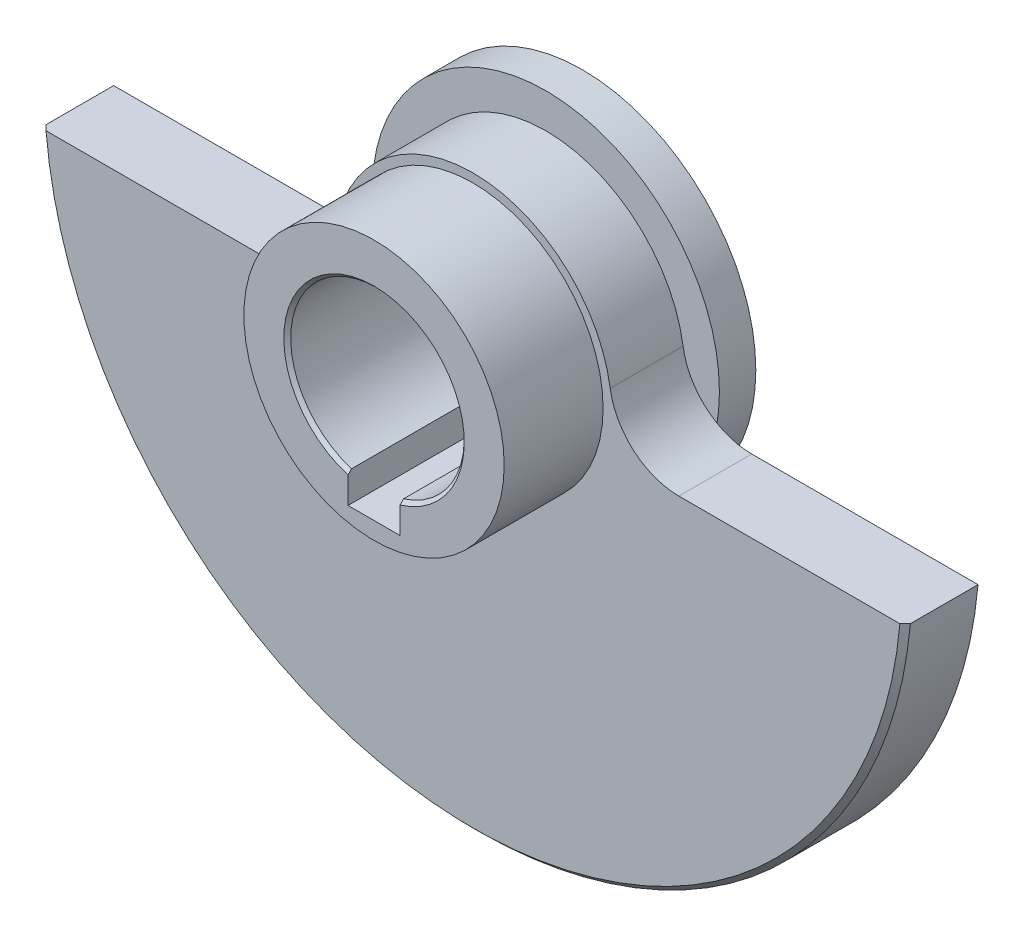
ISO-10303-21;
HEADER;
FILE_DESCRIPTION(('STEP AP214'),'2;1');
FILE_NAME('part.step','',(''),(''),'','','');
FILE_SCHEMA(('AUTOMOTIVE_DESIGN { 1 0 10303 214 1 1 1 1 }'));
ENDSEC;
DATA;
#1=APPLICATION_CONTEXT('core data for automotive mechanical design processes');
#2=APPLICATION_PROTOCOL_DEFINITION('international standard','automotive_design',2000,#1);
#3=PRODUCT_CONTEXT('',#1,'mechanical');
#4=PRODUCT('Part','Part','',(#3));
#5=PRODUCT_RELATED_PRODUCT_CATEGORY('part','',(#4));
#6=PRODUCT_DEFINITION_FORMATION('','',#4);
#7=PRODUCT_DEFINITION_CONTEXT('part definition',#1,'design');
#8=PRODUCT_DEFINITION('design','',#6,#7);
#9=PRODUCT_DEFINITION_SHAPE('','',#8);
#10=(LENGTH_UNIT() NAMED_UNIT(*) SI_UNIT(.MILLI.,.METRE.));
#11=(NAMED_UNIT(*) PLANE_ANGLE_UNIT() SI_UNIT($,.RADIAN.));
#12=(NAMED_UNIT(*) SI_UNIT($,.STERADIAN.) SOLID_ANGLE_UNIT());
#13=UNCERTAINTY_MEASURE_WITH_UNIT(LENGTH_MEASURE(1.E-05),#10,'distance_accuracy_value','');
#14=(GEOMETRIC_REPRESENTATION_CONTEXT(3) GLOBAL_UNCERTAINTY_ASSIGNED_CONTEXT((#13)) GLOBAL_UNIT_ASSIGNED_CONTEXT((#10,
#11,#12)) REPRESENTATION_CONTEXT('',''));
#15=CARTESIAN_POINT('',(0.,0.,0.));
#16=DIRECTION('',(0.,0.,1.));
#17=DIRECTION('',(1.,0.,0.));
#18=AXIS2_PLACEMENT_3D('',#15,#16,#17);
#19=CARTESIAN_POINT('',(0.,0.,0.));
#20=DIRECTION('',(0.,0.,-1.));
#21=DIRECTION('',(-1.,0.,0.));
#22=AXIS2_PLACEMENT_3D('',#19,#20,#21);
#23=CYLINDRICAL_SURFACE('',#22,25.);
#24=DIRECTION('',(0.,0.,-1.));
#25=VECTOR('',#24,1.);
#26=CARTESIAN_POINT('',(24.9030118660374,-2.2,0.));
#27=LINE('',#26,#25);
#28=CARTESIAN_POINT('',(24.9030118660374,-2.2,-4.2));
#29=VERTEX_POINT('',#28);
#30=CARTESIAN_POINT('',(24.9030118660374,-2.2,-0.300000000000002));
#31=VERTEX_POINT('',#30);
#32=EDGE_CURVE('E237',#29,#31,#27,.F.);
#33=ORIENTED_EDGE('',*,*,#32,.T.);
#34=CARTESIAN_POINT('',(0.,0.,-0.300000000000002));
#35=DIRECTION('',(0.,0.,1.));
#36=DIRECTION('',(1.,0.,0.));
#37=AXIS2_PLACEMENT_3D('',#34,#35,#36);
#38=CIRCLE('',#37,25.);
#39=CARTESIAN_POINT('',(-24.9030118660374,-2.2,-0.300000000000003));
#40=VERTEX_POINT('',#39);
#41=EDGE_CURVE('E39',#31,#40,#38,.F.);
#42=ORIENTED_EDGE('',*,*,#41,.T.);
#43=DIRECTION('',(0.,0.,-1.));
#44=VECTOR('',#43,1.);
#45=CARTESIAN_POINT('',(-24.9030118660374,-2.2,0.));
#46=LINE('',#45,#44);
#47=CARTESIAN_POINT('',(-24.9030118660374,-2.2,-4.2));
#48=VERTEX_POINT('',#47);
#49=EDGE_CURVE('E239',#40,#48,#46,.T.);
#50=ORIENTED_EDGE('',*,*,#49,.T.);
#51=CARTESIAN_POINT('',(0.,0.,-4.2));
#52=DIRECTION('',(0.,0.,1.));
#53=DIRECTION('',(1.,0.,0.));
#54=AXIS2_PLACEMENT_3D('',#51,#52,#53);
#55=CIRCLE('',#54,25.);
#56=EDGE_CURVE('E241',#48,#29,#55,.T.);
#57=ORIENTED_EDGE('',*,*,#56,.T.);
#58=EDGE_LOOP('',(#33,#42,#50,#57));
#59=FACE_BOUND('',#58,.T.);
#60=ADVANCED_FACE('F27',(#59),#23,.T.);
#61=CARTESIAN_POINT('',(-31.283198072784,-2.2,-4.2));
#62=DIRECTION('',(0.,-1.,0.));
#63=DIRECTION('',(0.,0.,-1.));
#64=AXIS2_PLACEMENT_3D('',#61,#62,#63);
#65=PLANE('',#64);
#66=ORIENTED_EDGE('',*,*,#49,.F.);
#67=CARTESIAN_POINT('',(-24.9030118660374,-2.2,-0.300000000000002));
#68=CARTESIAN_POINT('',(-24.8528159472193,-2.2,-0.249998803159777));
#69=CARTESIAN_POINT('',(-24.8026194323309,-2.2,-0.199998204739686));
#70=CARTESIAN_POINT('',(-24.7022252104135,-2.2,-0.0999982047396853));
#71=CARTESIAN_POINT('',(-24.6520275033844,-2.2,-0.0499988031597758));
#72=CARTESIAN_POINT('',(-24.6018292002851,-2.2,0.));
#73=B_SPLINE_CURVE_WITH_KNOTS('',3,(#67,#68,#69,#70,#71,#72),.UNSPECIFIED.,.F.,.F.,(4,2,4),(0.,
0.212550581141909,0.425101162284178),.UNSPECIFIED.);
#74=CARTESIAN_POINT('',(-24.6018292002851,-2.2,0.));
#75=VERTEX_POINT('',#74);
#76=EDGE_CURVE('E11',#40,#75,#73,.T.);
#77=ORIENTED_EDGE('',*,*,#76,.T.);
#78=DIRECTION('',(1.,0.,0.));
#79=VECTOR('',#78,1.);
#80=CARTESIAN_POINT('',(-31.283198072784,-2.2,0.));
#81=LINE('',#80,#79);
#82=CARTESIAN_POINT('',(-11.8642319599711,-2.2,0.));
#83=VERTEX_POINT('',#82);
#84=EDGE_CURVE('E233',#75,#83,#81,.T.);
#85=ORIENTED_EDGE('',*,*,#84,.T.);
#86=DIRECTION('',(0.,0.,1.));
#87=VECTOR('',#86,1.);
#88=CARTESIAN_POINT('',(-11.8642319599711,-2.2,-4.2));
#89=LINE('',#88,#87);
#90=CARTESIAN_POINT('',(-11.8642319599711,-2.2,-4.2));
#91=VERTEX_POINT('',#90);
#92=EDGE_CURVE('E227',#91,#83,#89,.T.);
#93=ORIENTED_EDGE('',*,*,#92,.F.);
#94=DIRECTION('',(1.,0.,0.));
#95=VECTOR('',#94,1.);
#96=CARTESIAN_POINT('',(-31.283198072784,-2.2,-4.2));
#97=LINE('',#96,#95);
#98=EDGE_CURVE('E236',#48,#91,#97,.T.);
#99=ORIENTED_EDGE('',*,*,#98,.F.);
#100=EDGE_LOOP('',(#66,#77,#85,#93,#99));
#101=FACE_BOUND('',#100,.T.);
#102=ADVANCED_FACE('F393',(#101),#65,.F.);
#103=CARTESIAN_POINT('',(0.,0.,-4.2));
#104=DIRECTION('',(0.,0.,1.));
#105=DIRECTION('',(1.,0.,0.));
#106=AXIS2_PLACEMENT_3D('',#103,#104,#105);
#107=PLANE('',#106);
#108=CARTESIAN_POINT('',(-11.8642319599711,1.8,-4.2));
#109=DIRECTION('',(0.,0.,-1.));
#110=DIRECTION('',(1.,0.,0.));
#111=AXIS2_PLACEMENT_3D('',#108,#109,#110);
#112=CIRCLE('',#111,4.);
#113=CARTESIAN_POINT('',(-9.86089181819035,-1.66217103510641,-4.2));
#114=VERTEX_POINT('',#113);
#115=EDGE_CURVE('E223',#114,#91,#112,.T.);
#116=ORIENTED_EDGE('',*,*,#115,.F.);
#117=CARTESIAN_POINT('',(0.,0.,-4.2));
#118=DIRECTION('',(0.,0.,1.));
#119=DIRECTION('',(1.,0.,0.));
#120=AXIS2_PLACEMENT_3D('',#117,#118,#119);
#121=CIRCLE('',#120,10.);
#122=CARTESIAN_POINT('',(9.86089181819035,-1.66217103510641,-4.2));
#123=VERTEX_POINT('',#122);
#124=EDGE_CURVE('E244',#114,#123,#121,.T.);
#125=ORIENTED_EDGE('',*,*,#124,.T.);
#126=CARTESIAN_POINT('',(11.8642319599711,1.8,-4.2));
#127=DIRECTION('',(0.,0.,-1.));
#128=DIRECTION('',(1.,0.,0.));
#129=AXIS2_PLACEMENT_3D('',#126,#127,#128);
#130=CIRCLE('',#129,4.);
#131=CARTESIAN_POINT('',(11.8642319599711,-2.2,-4.2));
#132=VERTEX_POINT('',#131);
#133=EDGE_CURVE('E212',#132,#123,#130,.T.);
#134=ORIENTED_EDGE('',*,*,#133,.F.);
#135=EDGE_CURVE('E234',#132,#29,#97,.T.);
#136=ORIENTED_EDGE('',*,*,#135,.T.);
#137=ORIENTED_EDGE('',*,*,#56,.F.);
#138=ORIENTED_EDGE('',*,*,#98,.T.);
#139=EDGE_LOOP('',(#116,#125,#134,#136,#137,#138));
#140=FACE_BOUND('',#139,.T.);
#141=ADVANCED_FACE('F385',(#140),#107,.F.);
#142=CARTESIAN_POINT('',(11.8642319599711,-2.2,0.));
#143=VERTEX_POINT('',#142);
#144=CARTESIAN_POINT('',(24.6018292002851,-2.2,0.));
#145=VERTEX_POINT('',#144);
#146=EDGE_CURVE('E230',#143,#145,#81,.T.);
#147=ORIENTED_EDGE('',*,*,#146,.T.);
#148=CARTESIAN_POINT('',(24.6018292002851,-2.2,0.));
#149=CARTESIAN_POINT('',(24.6520275033844,-2.2,-0.0499988031597761));
#150=CARTESIAN_POINT('',(24.7022252104135,-2.2,-0.0999982047396854));
#151=CARTESIAN_POINT('',(24.8026194323309,-2.2,-0.199998204739686));
#152=CARTESIAN_POINT('',(24.8528159472193,-2.2,-0.249998803159777));
#153=CARTESIAN_POINT('',(24.9030118660374,-2.2,-0.300000000000001));
#154=B_SPLINE_CURVE_WITH_KNOTS('',3,(#148,#149,#150,#151,#152,#153),.UNSPECIFIED.,.F.,.F.,(4,2,
4),(0.,0.212550581142269,0.425101162284177),.UNSPECIFIED.);
#155=EDGE_CURVE('E53',#145,#31,#154,.T.);
#156=ORIENTED_EDGE('',*,*,#155,.T.);
#157=ORIENTED_EDGE('',*,*,#32,.F.);
#158=ORIENTED_EDGE('',*,*,#135,.F.);
#159=DIRECTION('',(0.,0.,1.));
#160=VECTOR('',#159,1.);
#161=CARTESIAN_POINT('',(11.8642319599711,-2.2,-4.2));
#162=LINE('',#161,#160);
#163=EDGE_CURVE('E215',#132,#143,#162,.T.);
#164=ORIENTED_EDGE('',*,*,#163,.T.);
#165=EDGE_LOOP('',(#147,#156,#157,#158,#164));
#166=FACE_BOUND('',#165,.T.);
#167=ADVANCED_FACE('F409',(#166),#65,.F.);
#168=CARTESIAN_POINT('',(0.,0.,0.));
#169=DIRECTION('',(0.,0.,1.));
#170=DIRECTION('',(1.,0.,0.));
#171=AXIS2_PLACEMENT_3D('',#168,#169,#170);
#172=PLANE('',#171);
#173=ORIENTED_EDGE('',*,*,#84,.F.);
#174=CARTESIAN_POINT('',(0.,0.,0.));
#175=DIRECTION('',(0.,0.,1.));
#176=DIRECTION('',(1.,0.,0.));
#177=AXIS2_PLACEMENT_3D('',#174,#175,#176);
#178=CIRCLE('',#177,24.7);
#179=EDGE_CURVE('E301',#75,#145,#178,.T.);
#180=ORIENTED_EDGE('',*,*,#179,.T.);
#181=ORIENTED_EDGE('',*,*,#146,.F.);
#182=CARTESIAN_POINT('',(11.8642319599711,1.8,0.));
#183=DIRECTION('',(0.,0.,-1.));
#184=DIRECTION('',(1.,0.,0.));
#185=AXIS2_PLACEMENT_3D('',#182,#183,#184);
#186=CIRCLE('',#185,4.);
#187=CARTESIAN_POINT('',(7.90948797331408,1.2,0.));
#188=VERTEX_POINT('',#187);
#189=EDGE_CURVE('E208',#143,#188,#186,.T.);
#190=ORIENTED_EDGE('',*,*,#189,.T.);
#191=CARTESIAN_POINT('',(0.,0.,0.));
#192=DIRECTION('',(0.,0.,1.));
#193=DIRECTION('',(1.,0.,0.));
#194=AXIS2_PLACEMENT_3D('',#191,#192,#193);
#195=CIRCLE('',#194,8.);
#196=CARTESIAN_POINT('',(-7.90948797331408,1.2,0.));
#197=VERTEX_POINT('',#196);
#198=EDGE_CURVE('E199',#188,#197,#195,.T.);
#199=ORIENTED_EDGE('',*,*,#198,.T.);
#200=CARTESIAN_POINT('',(-11.8642319599711,1.8,0.));
#201=DIRECTION('',(0.,0.,-1.));
#202=DIRECTION('',(1.,0.,0.));
#203=AXIS2_PLACEMENT_3D('',#200,#201,#202);
#204=CIRCLE('',#203,4.);
#205=EDGE_CURVE('E218',#197,#83,#204,.T.);
#206=ORIENTED_EDGE('',*,*,#205,.T.);
#207=EDGE_LOOP('',(#173,#180,#181,#190,#199,#206));
#208=FACE_BOUND('',#207,.T.);
#209=CARTESIAN_POINT('',(0.,0.,0.));
#210=DIRECTION('',(0.,0.,1.));
#211=DIRECTION('',(1.,0.,0.));
#212=AXIS2_PLACEMENT_3D('',#209,#210,#211);
#213=CIRCLE('',#212,7.5);
#214=CARTESIAN_POINT('',(7.5,0.,0.));
#215=VERTEX_POINT('',#214);
#216=EDGE_CURVE('E202',#215,#215,#213,.T.);
#217=ORIENTED_EDGE('',*,*,#216,.F.);
#218=EDGE_LOOP('',(#217));
#219=FACE_BOUND('',#218,.T.);
#220=ADVANCED_FACE('F399',(#208,#219),#172,.T.);
#221=CARTESIAN_POINT('',(11.8642319599711,1.8,-4.2));
#222=DIRECTION('',(0.,0.,1.));
#223=DIRECTION('',(1.,0.,0.));
#224=AXIS2_PLACEMENT_3D('',#221,#222,#223);
#225=CYLINDRICAL_SURFACE('',#224,4.);
#226=ORIENTED_EDGE('',*,*,#189,.F.);
#227=ORIENTED_EDGE('',*,*,#163,.F.);
#228=ORIENTED_EDGE('',*,*,#133,.T.);
#229=CARTESIAN_POINT('',(7.90948797331408,1.2,-4.2));
#230=VERTEX_POINT('',#229);
#231=EDGE_CURVE('E211',#123,#230,#130,.T.);
#232=ORIENTED_EDGE('',*,*,#231,.T.);
#233=DIRECTION('',(0.,0.,1.));
#234=VECTOR('',#233,1.);
#235=CARTESIAN_POINT('',(7.90948797331408,1.2,-4.2));
#236=LINE('',#235,#234);
#237=EDGE_CURVE('E216',#230,#188,#236,.T.);
#238=ORIENTED_EDGE('',*,*,#237,.T.);
#239=EDGE_LOOP('',(#226,#227,#228,#232,#238));
#240=FACE_BOUND('',#239,.T.);
#241=ADVANCED_FACE('F414',(#240),#225,.F.);
#242=CARTESIAN_POINT('',(-11.8642319599711,1.8,-4.2));
#243=DIRECTION('',(0.,0.,1.));
#244=DIRECTION('',(1.,0.,0.));
#245=AXIS2_PLACEMENT_3D('',#242,#243,#244);
#246=CYLINDRICAL_SURFACE('',#245,4.);
#247=ORIENTED_EDGE('',*,*,#205,.F.);
#248=DIRECTION('',(0.,0.,1.));
#249=VECTOR('',#248,1.);
#250=CARTESIAN_POINT('',(-7.90948797331408,1.2,-4.2));
#251=LINE('',#250,#249);
#252=CARTESIAN_POINT('',(-7.90948797331408,1.2,-4.2));
#253=VERTEX_POINT('',#252);
#254=EDGE_CURVE('E226',#253,#197,#251,.T.);
#255=ORIENTED_EDGE('',*,*,#254,.F.);
#256=EDGE_CURVE('E224',#253,#114,#112,.T.);
#257=ORIENTED_EDGE('',*,*,#256,.T.);
#258=ORIENTED_EDGE('',*,*,#115,.T.);
#259=ORIENTED_EDGE('',*,*,#92,.T.);
#260=EDGE_LOOP('',(#247,#255,#257,#258,#259));
#261=FACE_BOUND('',#260,.T.);
#262=ADVANCED_FACE('F391',(#261),#246,.F.);
#263=CARTESIAN_POINT('',(0.,0.,5.7));
#264=DIRECTION('',(0.,0.,1.));
#265=DIRECTION('',(1.,0.,0.));
#266=AXIS2_PLACEMENT_3D('',#263,#264,#265);
#267=CYLINDRICAL_SURFACE('',#266,5.);
#268=DIRECTION('',(0.,0.,1.));
#269=VECTOR('',#268,1.);
#270=CARTESIAN_POINT('',(-1.5,-4.76969600708473,5.7));
#271=LINE('',#270,#269);
#272=CARTESIAN_POINT('',(-1.5,-4.76969600708473,-6.1));
#273=VERTEX_POINT('',#272);
#274=CARTESIAN_POINT('',(-1.5,-4.76969600708473,5.5));
#275=VERTEX_POINT('',#274);
#276=EDGE_CURVE('E188',#273,#275,#271,.T.);
#277=ORIENTED_EDGE('',*,*,#276,.F.);
#278=CARTESIAN_POINT('',(0.,0.,-6.1));
#279=DIRECTION('',(0.,0.,-1.));
#280=DIRECTION('',(-1.,0.,0.));
#281=AXIS2_PLACEMENT_3D('',#278,#279,#280);
#282=CIRCLE('',#281,5.);
#283=CARTESIAN_POINT('',(1.5,-4.76969600708473,-6.1));
#284=VERTEX_POINT('',#283);
#285=EDGE_CURVE('E286',#273,#284,#282,.T.);
#286=ORIENTED_EDGE('',*,*,#285,.T.);
#287=DIRECTION('',(0.,0.,1.));
#288=VECTOR('',#287,1.);
#289=CARTESIAN_POINT('',(1.5,-4.76969600708473,5.7));
#290=LINE('',#289,#288);
#291=CARTESIAN_POINT('',(1.5,-4.76969600708473,5.5));
#292=VERTEX_POINT('',#291);
#293=EDGE_CURVE('E183',#292,#284,#290,.F.);
#294=ORIENTED_EDGE('',*,*,#293,.F.);
#295=CARTESIAN_POINT('',(0.,0.,5.5));
#296=DIRECTION('',(0.,0.,1.));
#297=DIRECTION('',(1.,0.,0.));
#298=AXIS2_PLACEMENT_3D('',#295,#296,#297);
#299=CIRCLE('',#298,5.);
#300=EDGE_CURVE('E252',#292,#275,#299,.T.);
#301=ORIENTED_EDGE('',*,*,#300,.T.);
#302=EDGE_LOOP('',(#277,#286,#294,#301));
#303=FACE_BOUND('',#302,.T.);
#304=ADVANCED_FACE('F330',(#303),#267,.F.);
#305=CARTESIAN_POINT('',(0.,5.,5.7));
#306=DIRECTION('',(0.,0.,1.));
#307=DIRECTION('',(1.,0.,0.));
#308=AXIS2_PLACEMENT_3D('',#305,#306,#307);
#309=PLANE('',#308);
#310=DIRECTION('',(0.,-1.,0.));
#311=VECTOR('',#310,1.);
#312=CARTESIAN_POINT('',(-1.5,-6.5,5.7));
#313=LINE('',#312,#311);
#314=CARTESIAN_POINT('',(-1.5,-4.97895571380184,5.7));
#315=VERTEX_POINT('',#314);
#316=CARTESIAN_POINT('',(-1.5,-6.5,5.7));
#317=VERTEX_POINT('',#316);
#318=EDGE_CURVE('E324',#315,#317,#313,.T.);
#319=ORIENTED_EDGE('',*,*,#318,.F.);
#320=CARTESIAN_POINT('',(0.,0.,5.7));
#321=DIRECTION('',(0.,0.,1.));
#322=DIRECTION('',(1.,0.,0.));
#323=AXIS2_PLACEMENT_3D('',#320,#321,#322);
#324=CIRCLE('',#323,5.2);
#325=CARTESIAN_POINT('',(1.5,-4.97895571380184,5.7));
#326=VERTEX_POINT('',#325);
#327=EDGE_CURVE('E262',#315,#326,#324,.F.);
#328=ORIENTED_EDGE('',*,*,#327,.T.);
#329=DIRECTION('',(0.,1.,0.));
#330=VECTOR('',#329,1.);
#331=CARTESIAN_POINT('',(1.5,-1.76191842262744,5.7));
#332=LINE('',#331,#330);
#333=CARTESIAN_POINT('',(1.5,-6.5,5.7));
#334=VERTEX_POINT('',#333);
#335=EDGE_CURVE('E172',#334,#326,#332,.T.);
#336=ORIENTED_EDGE('',*,*,#335,.F.);
#337=DIRECTION('',(1.,0.,0.));
#338=VECTOR('',#337,1.);
#339=CARTESIAN_POINT('',(1.5,-6.5,5.7));
#340=LINE('',#339,#338);
#341=EDGE_CURVE('E176',#317,#334,#340,.T.);
#342=ORIENTED_EDGE('',*,*,#341,.F.);
#343=EDGE_LOOP('',(#319,#328,#336,#342));
#344=FACE_BOUND('',#343,.T.);
#345=CARTESIAN_POINT('',(0.,0.,5.7));
#346=DIRECTION('',(0.,0.,1.));
#347=DIRECTION('',(1.,0.,0.));
#348=AXIS2_PLACEMENT_3D('',#345,#346,#347);
#349=CIRCLE('',#348,7.5);
#350=CARTESIAN_POINT('',(7.5,0.,5.7));
#351=VERTEX_POINT('',#350);
#352=EDGE_CURVE('E205',#351,#351,#349,.T.);
#353=ORIENTED_EDGE('',*,*,#352,.T.);
#354=EDGE_LOOP('',(#353));
#355=FACE_BOUND('',#354,.T.);
#356=ADVANCED_FACE('F321',(#344,#355),#309,.T.);
#357=CARTESIAN_POINT('',(0.,10.,-6.3));
#358=DIRECTION('',(0.,0.,-1.));
#359=DIRECTION('',(-1.,0.,0.));
#360=AXIS2_PLACEMENT_3D('',#357,#358,#359);
#361=PLANE('',#360);
#362=CARTESIAN_POINT('',(6.49519052838334,3.74999999999992,-6.3));
#363=DIRECTION('',(0.,0.,-1.));
#364=DIRECTION('',(-0.866025403784445,-0.499999999999989,0.));
#365=AXIS2_PLACEMENT_3D('',#362,#363,#364);
#366=CIRCLE('',#365,1.5);
#367=CARTESIAN_POINT('',(5.19615242270667,2.99999999999993,-6.3));
#368=VERTEX_POINT('',#367);
#369=EDGE_CURVE('E717',#368,#368,#366,.T.);
#370=ORIENTED_EDGE('',*,*,#369,.F.);
#371=EDGE_LOOP('',(#370));
#372=FACE_BOUND('',#371,.T.);
#373=CARTESIAN_POINT('',(3.75000000000008,6.49519052838325,-6.3));
#374=DIRECTION('',(0.,0.,-1.));
#375=DIRECTION('',(-0.50000000000001,-0.866025403784433,0.));
#376=AXIS2_PLACEMENT_3D('',#373,#374,#375);
#377=CIRCLE('',#376,1.5);
#378=CARTESIAN_POINT('',(3.00000000000006,5.1961524227066,-6.3));
#379=VERTEX_POINT('',#378);
#380=EDGE_CURVE('E716',#379,#379,#377,.T.);
#381=ORIENTED_EDGE('',*,*,#380,.F.);
#382=EDGE_LOOP('',(#381));
#383=FACE_BOUND('',#382,.T.);
#384=CARTESIAN_POINT('',(0.,7.5,-6.3));
#385=DIRECTION('',(0.,0.,-1.));
#386=DIRECTION('',(0.,-1.,0.));
#387=AXIS2_PLACEMENT_3D('',#384,#385,#386);
#388=CIRCLE('',#387,1.5);
#389=CARTESIAN_POINT('',(0.,6.,-6.3));
#390=VERTEX_POINT('',#389);
#391=EDGE_CURVE('E727',#390,#390,#388,.T.);
#392=ORIENTED_EDGE('',*,*,#391,.F.);
#393=EDGE_LOOP('',(#392));
#394=FACE_BOUND('',#393,.T.);
#395=CARTESIAN_POINT('',(-3.74999999999994,6.49519052838332,-6.3));
#396=DIRECTION('',(0.,0.,-1.));
#397=DIRECTION('',(0.499999999999992,-0.866025403784443,0.));
#398=AXIS2_PLACEMENT_3D('',#395,#396,#397);
#399=CIRCLE('',#398,1.5);
#400=CARTESIAN_POINT('',(-2.99999999999995,5.19615242270666,-6.3));
#401=VERTEX_POINT('',#400);
#402=EDGE_CURVE('E733',#401,#401,#399,.T.);
#403=ORIENTED_EDGE('',*,*,#402,.F.);
#404=EDGE_LOOP('',(#403));
#405=FACE_BOUND('',#404,.T.);
#406=CARTESIAN_POINT('',(-6.49519052838326,3.75000000000005,-6.3));
#407=DIRECTION('',(0.,0.,-1.));
#408=DIRECTION('',(0.866025403784435,-0.500000000000007,0.));
#409=AXIS2_PLACEMENT_3D('',#406,#407,#408);
#410=CIRCLE('',#409,1.5);
#411=CARTESIAN_POINT('',(-5.19615242270661,3.00000000000004,-6.3));
#412=VERTEX_POINT('',#411);
#413=EDGE_CURVE('E739',#412,#412,#410,.T.);
#414=ORIENTED_EDGE('',*,*,#413,.F.);
#415=EDGE_LOOP('',(#414));
#416=FACE_BOUND('',#415,.T.);
#417=CARTESIAN_POINT('',(-7.5,0.,-6.3));
#418=DIRECTION('',(0.,0.,-1.));
#419=DIRECTION('',(1.,0.,0.));
#420=AXIS2_PLACEMENT_3D('',#417,#418,#419);
#421=CIRCLE('',#420,1.5);
#422=CARTESIAN_POINT('',(-6.,0.,-6.3));
#423=VERTEX_POINT('',#422);
#424=EDGE_CURVE('E745',#423,#423,#421,.T.);
#425=ORIENTED_EDGE('',*,*,#424,.F.);
#426=EDGE_LOOP('',(#425));
#427=FACE_BOUND('',#426,.T.);
#428=CARTESIAN_POINT('',(-6.49519052838331,-3.74999999999996,-6.3));
#429=DIRECTION('',(0.,0.,-1.));
#430=DIRECTION('',(0.866025403784442,0.499999999999995,0.));
#431=AXIS2_PLACEMENT_3D('',#428,#429,#430);
#432=CIRCLE('',#431,1.5);
#433=CARTESIAN_POINT('',(-5.19615242270665,-2.99999999999997,-6.3));
#434=VERTEX_POINT('',#433);
#435=EDGE_CURVE('E751',#434,#434,#432,.T.);
#436=ORIENTED_EDGE('',*,*,#435,.F.);
#437=EDGE_LOOP('',(#436));
#438=FACE_BOUND('',#437,.T.);
#439=CARTESIAN_POINT('',(-3.75000000000003,-6.49519052838327,-6.3));
#440=DIRECTION('',(0.,0.,-1.));
#441=DIRECTION('',(0.500000000000004,0.866025403784436,0.));
#442=AXIS2_PLACEMENT_3D('',#439,#440,#441);
#443=CIRCLE('',#442,1.5);
#444=CARTESIAN_POINT('',(-3.00000000000002,-5.19615242270662,-6.3));
#445=VERTEX_POINT('',#444);
#446=EDGE_CURVE('E757',#445,#445,#443,.T.);
#447=ORIENTED_EDGE('',*,*,#446,.F.);
#448=EDGE_LOOP('',(#447));
#449=FACE_BOUND('',#448,.T.);
#450=DIRECTION('',(0.,1.,0.));
#451=VECTOR('',#450,1.);
#452=CARTESIAN_POINT('',(1.5,-1.76191842262744,-6.3));
#453=LINE('',#452,#451);
#454=CARTESIAN_POINT('',(1.5,-6.5,-6.3));
#455=VERTEX_POINT('',#454);
#456=CARTESIAN_POINT('',(1.5,-4.97895571380184,-6.3));
#457=VERTEX_POINT('',#456);
#458=EDGE_CURVE('E174',#455,#457,#453,.T.);
#459=ORIENTED_EDGE('',*,*,#458,.T.);
#460=CARTESIAN_POINT('',(0.,0.,-6.3));
#461=DIRECTION('',(0.,0.,-1.));
#462=DIRECTION('',(-1.,0.,0.));
#463=AXIS2_PLACEMENT_3D('',#460,#461,#462);
#464=CIRCLE('',#463,5.2);
#465=CARTESIAN_POINT('',(-1.5,-4.97895571380184,-6.3));
#466=VERTEX_POINT('',#465);
#467=EDGE_CURVE('E287',#457,#466,#464,.F.);
#468=ORIENTED_EDGE('',*,*,#467,.T.);
#469=DIRECTION('',(0.,1.,0.));
#470=VECTOR('',#469,1.);
#471=CARTESIAN_POINT('',(-1.5,10.,-6.3));
#472=LINE('',#471,#470);
#473=CARTESIAN_POINT('',(-1.5,-6.5,-6.3));
#474=VERTEX_POINT('',#473);
#475=EDGE_CURVE('E247',#474,#466,#472,.T.);
#476=ORIENTED_EDGE('',*,*,#475,.F.);
#477=DIRECTION('',(1.,0.,0.));
#478=VECTOR('',#477,1.);
#479=CARTESIAN_POINT('',(1.5,-6.5,-6.3));
#480=LINE('',#479,#478);
#481=CARTESIAN_POINT('',(-1.11803398874992,-6.5,-6.3));
#482=VERTEX_POINT('',#481);
#483=EDGE_CURVE('E165',#474,#482,#480,.T.);
#484=ORIENTED_EDGE('',*,*,#483,.T.);
#485=CARTESIAN_POINT('',(0.,-7.5,-6.3));
#486=DIRECTION('',(0.,0.,-1.));
#487=DIRECTION('',(0.,1.,0.));
#488=AXIS2_PLACEMENT_3D('',#485,#486,#487);
#489=CIRCLE('',#488,1.5);
#490=CARTESIAN_POINT('',(1.11803398874987,-6.5,-6.3));
#491=VERTEX_POINT('',#490);
#492=EDGE_CURVE('E147',#491,#482,#489,.T.);
#493=ORIENTED_EDGE('',*,*,#492,.F.);
#494=EDGE_CURVE('E161',#491,#455,#480,.T.);
#495=ORIENTED_EDGE('',*,*,#494,.T.);
#496=EDGE_LOOP('',(#459,#468,#476,#484,#493,#495));
#497=FACE_BOUND('',#496,.T.);
#498=CARTESIAN_POINT('',(3.74999999999998,-6.4951905283833,-6.3));
#499=DIRECTION('',(0.,0.,-1.));
#500=DIRECTION('',(-0.499999999999998,0.86602540378444,0.));
#501=AXIS2_PLACEMENT_3D('',#498,#499,#500);
#502=CIRCLE('',#501,1.5);
#503=CARTESIAN_POINT('',(2.99999999999999,-5.19615242270664,-6.3));
#504=VERTEX_POINT('',#503);
#505=EDGE_CURVE('E336',#504,#504,#502,.T.);
#506=ORIENTED_EDGE('',*,*,#505,.F.);
#507=EDGE_LOOP('',(#506));
#508=FACE_BOUND('',#507,.T.);
#509=CARTESIAN_POINT('',(6.49519052838328,-3.75000000000001,-6.3));
#510=DIRECTION('',(0.,0.,-1.));
#511=DIRECTION('',(-0.866025403784438,0.500000000000001,0.));
#512=AXIS2_PLACEMENT_3D('',#509,#510,#511);
#513=CIRCLE('',#512,1.5);
#514=CARTESIAN_POINT('',(5.19615242270663,-3.00000000000001,-6.3));
#515=VERTEX_POINT('',#514);
#516=EDGE_CURVE('E345',#515,#515,#513,.T.);
#517=ORIENTED_EDGE('',*,*,#516,.F.);
#518=EDGE_LOOP('',(#517));
#519=FACE_BOUND('',#518,.T.);
#520=CARTESIAN_POINT('',(7.5,0.,-6.3));
#521=DIRECTION('',(0.,0.,-1.));
#522=DIRECTION('',(-1.,0.,0.));
#523=AXIS2_PLACEMENT_3D('',#520,#521,#522);
#524=CIRCLE('',#523,1.5);
#525=CARTESIAN_POINT('',(6.,0.,-6.3));
#526=VERTEX_POINT('',#525);
#527=EDGE_CURVE('E351',#526,#526,#524,.T.);
#528=ORIENTED_EDGE('',*,*,#527,.F.);
#529=EDGE_LOOP('',(#528));
#530=FACE_BOUND('',#529,.T.);
#531=CARTESIAN_POINT('',(0.,0.,-6.3));
#532=DIRECTION('',(0.,0.,1.));
#533=DIRECTION('',(1.,0.,0.));
#534=AXIS2_PLACEMENT_3D('',#531,#532,#533);
#535=CIRCLE('',#534,10.);
#536=CARTESIAN_POINT('',(10.,0.,-6.3));
#537=VERTEX_POINT('',#536);
#538=EDGE_CURVE('E190',#537,#537,#535,.T.);
#539=ORIENTED_EDGE('',*,*,#538,.F.);
#540=EDGE_LOOP('',(#539));
#541=FACE_BOUND('',#540,.T.);
#542=ADVANCED_FACE('F159',(#372,#383,#394,#405,#416,#427,#438,#449,#497,#508,#519,#530,#541),
#361,.T.);
#543=CARTESIAN_POINT('',(0.,0.,5.7));
#544=DIRECTION('',(0.,0.,1.));
#545=DIRECTION('',(1.,0.,0.));
#546=AXIS2_PLACEMENT_3D('',#543,#544,#545);
#547=CYLINDRICAL_SURFACE('',#546,7.5);
#548=ORIENTED_EDGE('',*,*,#216,.T.);
#549=EDGE_LOOP('',(#548));
#550=FACE_BOUND('',#549,.T.);
#551=ORIENTED_EDGE('',*,*,#352,.F.);
#552=EDGE_LOOP('',(#551));
#553=FACE_BOUND('',#552,.T.);
#554=ADVANCED_FACE('F367',(#550,#553),#547,.T.);
#555=CARTESIAN_POINT('',(0.,0.,5.7));
#556=DIRECTION('',(0.,0.,1.));
#557=DIRECTION('',(1.,0.,0.));
#558=AXIS2_PLACEMENT_3D('',#555,#556,#557);
#559=CYLINDRICAL_SURFACE('',#558,8.);
#560=CARTESIAN_POINT('',(0.,0.,-4.2));
#561=DIRECTION('',(0.,0.,1.));
#562=DIRECTION('',(1.,0.,0.));
#563=AXIS2_PLACEMENT_3D('',#560,#561,#562);
#564=CIRCLE('',#563,8.);
#565=EDGE_CURVE('E196',#230,#253,#564,.T.);
#566=ORIENTED_EDGE('',*,*,#565,.T.);
#567=ORIENTED_EDGE('',*,*,#254,.T.);
#568=ORIENTED_EDGE('',*,*,#198,.F.);
#569=ORIENTED_EDGE('',*,*,#237,.F.);
#570=EDGE_LOOP('',(#566,#567,#568,#569));
#571=FACE_BOUND('',#570,.T.);
#572=ADVANCED_FACE('F374',(#571),#559,.T.);
#573=CARTESIAN_POINT('',(0.,0.,5.7));
#574=DIRECTION('',(0.,0.,1.));
#575=DIRECTION('',(1.,0.,0.));
#576=AXIS2_PLACEMENT_3D('',#573,#574,#575);
#577=CYLINDRICAL_SURFACE('',#576,10.);
#578=ORIENTED_EDGE('',*,*,#538,.T.);
#579=EDGE_LOOP('',(#578));
#580=FACE_BOUND('',#579,.T.);
#581=ORIENTED_EDGE('',*,*,#124,.F.);
#582=CARTESIAN_POINT('',(0.,0.,-4.2));
#583=DIRECTION('',(0.,0.,1.));
#584=DIRECTION('',(1.,0.,0.));
#585=AXIS2_PLACEMENT_3D('',#582,#583,#584);
#586=CIRCLE('',#585,10.);
#587=EDGE_CURVE('E193',#123,#114,#586,.T.);
#588=ORIENTED_EDGE('',*,*,#587,.F.);
#589=EDGE_LOOP('',(#581,#588));
#590=FACE_BOUND('',#589,.T.);
#591=ADVANCED_FACE('F369',(#580,#590),#577,.T.);
#592=CARTESIAN_POINT('',(0.,8.,-4.2));
#593=DIRECTION('',(0.,0.,1.));
#594=DIRECTION('',(1.,0.,0.));
#595=AXIS2_PLACEMENT_3D('',#592,#593,#594);
#596=PLANE('',#595);
#597=ORIENTED_EDGE('',*,*,#587,.T.);
#598=ORIENTED_EDGE('',*,*,#256,.F.);
#599=ORIENTED_EDGE('',*,*,#565,.F.);
#600=ORIENTED_EDGE('',*,*,#231,.F.);
#601=EDGE_LOOP('',(#597,#598,#599,#600));
#602=FACE_BOUND('',#601,.T.);
#603=ADVANCED_FACE('F274',(#602),#596,.T.);
#604=CARTESIAN_POINT('',(-1.5,-6.5,-6.3));
#605=DIRECTION('',(-1.,0.,0.));
#606=DIRECTION('',(0.,0.,1.));
#607=AXIS2_PLACEMENT_3D('',#604,#605,#606);
#608=PLANE('',#607);
#609=ORIENTED_EDGE('',*,*,#475,.T.);
#610=CARTESIAN_POINT('',(-1.5,-4.97895571380184,-6.3));
#611=CARTESIAN_POINT('',(-1.5,-4.94411002548037,-6.26663430550779));
#612=CARTESIAN_POINT('',(-1.5,-4.9092488725002,-6.23328479166529));
#613=CARTESIAN_POINT('',(-1.5,-4.83949563692809,-6.16661812499835));
#614=CARTESIAN_POINT('',(-1.5,-4.80460355433589,-6.13330097217418));
#615=CARTESIAN_POINT('',(-1.5,-4.76969600708473,-6.1));
#616=B_SPLINE_CURVE_WITH_KNOTS('',3,(#610,#611,#612,#613,#614,#615),.UNSPECIFIED.,.F.,.F.,(4,2,
4),(0.,0.144732202863564,0.289464406948803),.UNSPECIFIED.);
#617=EDGE_CURVE('E280',#466,#273,#616,.T.);
#618=ORIENTED_EDGE('',*,*,#617,.T.);
#619=ORIENTED_EDGE('',*,*,#276,.T.);
#620=CARTESIAN_POINT('',(-1.5,-4.76969600708473,5.5));
#621=CARTESIAN_POINT('',(-1.5,-4.80460355433589,5.53330097217419));
#622=CARTESIAN_POINT('',(-1.5,-4.83949563692809,5.56661812499835));
#623=CARTESIAN_POINT('',(-1.5,-4.9092488725002,5.63328479166529));
#624=CARTESIAN_POINT('',(-1.5,-4.94411002548036,5.66663430550779));
#625=CARTESIAN_POINT('',(-1.5,-4.97895571380184,5.7));
#626=B_SPLINE_CURVE_WITH_KNOTS('',3,(#620,#621,#622,#623,#624,#625),.UNSPECIFIED.,.F.,.F.,(4,2,
4),(0.,0.144732204085233,0.28946440694879),.UNSPECIFIED.);
#627=EDGE_CURVE('E255',#275,#315,#626,.T.);
#628=ORIENTED_EDGE('',*,*,#627,.T.);
#629=ORIENTED_EDGE('',*,*,#318,.T.);
#630=DIRECTION('',(0.,0.,1.));
#631=VECTOR('',#630,1.);
#632=CARTESIAN_POINT('',(-1.5,-6.5,-6.3));
#633=LINE('',#632,#631);
#634=EDGE_CURVE('E181',#474,#317,#633,.T.);
#635=ORIENTED_EDGE('',*,*,#634,.F.);
#636=EDGE_LOOP('',(#609,#618,#619,#628,#629,#635));
#637=FACE_BOUND('',#636,.T.);
#638=ADVANCED_FACE('F268',(#637),#608,.F.);
#639=CARTESIAN_POINT('',(1.5,-1.76191842262744,-6.3));
#640=DIRECTION('',(1.,0.,0.));
#641=DIRECTION('',(0.,0.,-1.));
#642=AXIS2_PLACEMENT_3D('',#639,#640,#641);
#643=PLANE('',#642);
#644=ORIENTED_EDGE('',*,*,#293,.T.);
#645=CARTESIAN_POINT('',(1.5,-4.76969600708473,-6.1));
#646=CARTESIAN_POINT('',(1.5,-4.80460355433589,-6.13330097217418));
#647=CARTESIAN_POINT('',(1.5,-4.83949563692809,-6.16661812499835));
#648=CARTESIAN_POINT('',(1.5,-4.9092488725002,-6.23328479166529));
#649=CARTESIAN_POINT('',(1.5,-4.94411002548037,-6.26663430550779));
#650=CARTESIAN_POINT('',(1.5,-4.97895571380184,-6.3));
#651=B_SPLINE_CURVE_WITH_KNOTS('',3,(#645,#646,#647,#648,#649,#650),.UNSPECIFIED.,.F.,.F.,(4,2,
4),(0.,0.144732204085239,0.289464406948803),.UNSPECIFIED.);
#652=EDGE_CURVE('E296',#284,#457,#651,.T.);
#653=ORIENTED_EDGE('',*,*,#652,.T.);
#654=ORIENTED_EDGE('',*,*,#458,.F.);
#655=DIRECTION('',(0.,0.,1.));
#656=VECTOR('',#655,1.);
#657=CARTESIAN_POINT('',(1.5,-6.5,-6.3));
#658=LINE('',#657,#656);
#659=EDGE_CURVE('E171',#455,#334,#658,.T.);
#660=ORIENTED_EDGE('',*,*,#659,.T.);
#661=ORIENTED_EDGE('',*,*,#335,.T.);
#662=CARTESIAN_POINT('',(1.5,-4.97895571380184,5.7));
#663=CARTESIAN_POINT('',(1.5,-4.94411002548036,5.66663430550779));
#664=CARTESIAN_POINT('',(1.5,-4.9092488725002,5.63328479166529));
#665=CARTESIAN_POINT('',(1.5,-4.83949563692809,5.56661812499835));
#666=CARTESIAN_POINT('',(1.5,-4.80460355433588,5.53330097217419));
#667=CARTESIAN_POINT('',(1.5,-4.76969600708473,5.5));
#668=B_SPLINE_CURVE_WITH_KNOTS('',3,(#662,#663,#664,#665,#666,#667),.UNSPECIFIED.,.F.,.F.,(4,2,
4),(0.,0.144732202863558,0.28946440694879),.UNSPECIFIED.);
#669=EDGE_CURVE('E310',#326,#292,#668,.T.);
#670=ORIENTED_EDGE('',*,*,#669,.T.);
#671=EDGE_LOOP('',(#644,#653,#654,#660,#661,#670));
#672=FACE_BOUND('',#671,.T.);
#673=ADVANCED_FACE('F273',(#672),#643,.F.);
#674=CARTESIAN_POINT('',(1.5,-6.5,-6.3));
#675=DIRECTION('',(0.,-1.,0.));
#676=DIRECTION('',(0.,0.,-1.));
#677=AXIS2_PLACEMENT_3D('',#674,#675,#676);
#678=PLANE('',#677);
#679=DIRECTION('',(1.,0.,0.));
#680=VECTOR('',#679,1.);
#681=CARTESIAN_POINT('',(1.5,-6.5,-5.3));
#682=LINE('',#681,#680);
#683=CARTESIAN_POINT('',(-1.11803398874992,-6.5,-5.3));
#684=VERTEX_POINT('',#683);
#685=CARTESIAN_POINT('',(1.11803398874987,-6.5,-5.3));
#686=VERTEX_POINT('',#685);
#687=EDGE_CURVE('E154',#684,#686,#682,.T.);
#688=ORIENTED_EDGE('',*,*,#687,.F.);
#689=DIRECTION('',(0.,0.,-1.));
#690=VECTOR('',#689,1.);
#691=CARTESIAN_POINT('',(-1.11803398874992,-6.5,-5.3));
#692=LINE('',#691,#690);
#693=EDGE_CURVE('E153',#684,#482,#692,.T.);
#694=ORIENTED_EDGE('',*,*,#693,.T.);
#695=ORIENTED_EDGE('',*,*,#483,.F.);
#696=ORIENTED_EDGE('',*,*,#634,.T.);
#697=ORIENTED_EDGE('',*,*,#341,.T.);
#698=ORIENTED_EDGE('',*,*,#659,.F.);
#699=ORIENTED_EDGE('',*,*,#494,.F.);
#700=DIRECTION('',(0.,0.,-1.));
#701=VECTOR('',#700,1.);
#702=CARTESIAN_POINT('',(1.11803398874987,-6.5,-5.3));
#703=LINE('',#702,#701);
#704=EDGE_CURVE('E143',#491,#686,#703,.F.);
#705=ORIENTED_EDGE('',*,*,#704,.T.);
#706=EDGE_LOOP('',(#688,#694,#695,#696,#697,#698,#699,#705));
#707=FACE_BOUND('',#706,.T.);
#708=ADVANCED_FACE('F169',(#707),#678,.F.);
#709=CARTESIAN_POINT('',(7.5,0.,-5.3));
#710=DIRECTION('',(0.,0.,-1.));
#711=DIRECTION('',(-1.,0.,0.));
#712=AXIS2_PLACEMENT_3D('',#709,#710,#711);
#713=CYLINDRICAL_SURFACE('',#712,1.5);
#714=CARTESIAN_POINT('',(7.5,0.,-5.3));
#715=DIRECTION('',(0.,0.,-1.));
#716=DIRECTION('',(-1.,0.,0.));
#717=AXIS2_PLACEMENT_3D('',#714,#715,#716);
#718=CIRCLE('',#717,1.5);
#719=CARTESIAN_POINT('',(6.,0.,-5.3));
#720=VERTEX_POINT('',#719);
#721=EDGE_CURVE('E354',#720,#720,#718,.T.);
#722=ORIENTED_EDGE('',*,*,#721,.F.);
#723=EDGE_LOOP('',(#722));
#724=FACE_BOUND('',#723,.T.);
#725=ORIENTED_EDGE('',*,*,#527,.T.);
#726=EDGE_LOOP('',(#725));
#727=FACE_BOUND('',#726,.T.);
#728=ADVANCED_FACE('F307',(#724,#727),#713,.F.);
#729=CARTESIAN_POINT('',(7.5,0.,-5.3));
#730=DIRECTION('',(0.,0.,-1.));
#731=DIRECTION('',(-1.,0.,0.));
#732=AXIS2_PLACEMENT_3D('',#729,#730,#731);
#733=PLANE('',#732);
#734=ORIENTED_EDGE('',*,*,#721,.T.);
#735=EDGE_LOOP('',(#734));
#736=FACE_BOUND('',#735,.T.);
#737=ADVANCED_FACE('F359',(#736),#733,.T.);
#738=CARTESIAN_POINT('',(6.49519052838328,-3.75000000000001,-5.3));
#739=DIRECTION('',(0.,0.,-1.));
#740=DIRECTION('',(-1.,0.,0.));
#741=AXIS2_PLACEMENT_3D('',#738,#739,#740);
#742=CYLINDRICAL_SURFACE('',#741,1.5);
#743=CARTESIAN_POINT('',(6.49519052838328,-3.75000000000001,-5.3));
#744=DIRECTION('',(0.,0.,-1.));
#745=DIRECTION('',(-0.866025403784438,0.500000000000001,0.));
#746=AXIS2_PLACEMENT_3D('',#743,#744,#745);
#747=CIRCLE('',#746,1.5);
#748=CARTESIAN_POINT('',(5.19615242270663,-3.00000000000001,-5.3));
#749=VERTEX_POINT('',#748);
#750=EDGE_CURVE('E348',#749,#749,#747,.T.);
#751=ORIENTED_EDGE('',*,*,#750,.F.);
#752=EDGE_LOOP('',(#751));
#753=FACE_BOUND('',#752,.T.);
#754=ORIENTED_EDGE('',*,*,#516,.T.);
#755=EDGE_LOOP('',(#754));
#756=FACE_BOUND('',#755,.T.);
#757=ADVANCED_FACE('F453',(#753,#756),#742,.F.);
#758=CARTESIAN_POINT('',(6.49519052838328,-3.75000000000001,-5.3));
#759=DIRECTION('',(0.,0.,-1.));
#760=DIRECTION('',(-0.866025403784438,0.500000000000001,0.));
#761=AXIS2_PLACEMENT_3D('',#758,#759,#760);
#762=PLANE('',#761);
#763=ORIENTED_EDGE('',*,*,#750,.T.);
#764=EDGE_LOOP('',(#763));
#765=FACE_BOUND('',#764,.T.);
#766=ADVANCED_FACE('F464',(#765),#762,.T.);
#767=CARTESIAN_POINT('',(3.74999999999998,-6.4951905283833,-5.3));
#768=DIRECTION('',(0.,0.,-1.));
#769=DIRECTION('',(-1.,0.,0.));
#770=AXIS2_PLACEMENT_3D('',#767,#768,#769);
#771=CYLINDRICAL_SURFACE('',#770,1.5);
#772=CARTESIAN_POINT('',(3.74999999999998,-6.4951905283833,-5.3));
#773=DIRECTION('',(0.,0.,-1.));
#774=DIRECTION('',(-0.499999999999998,0.86602540378444,0.));
#775=AXIS2_PLACEMENT_3D('',#772,#773,#774);
#776=CIRCLE('',#775,1.5);
#777=CARTESIAN_POINT('',(2.99999999999999,-5.19615242270664,-5.3));
#778=VERTEX_POINT('',#777);
#779=EDGE_CURVE('E339',#778,#778,#776,.T.);
#780=ORIENTED_EDGE('',*,*,#779,.F.);
#781=EDGE_LOOP('',(#780));
#782=FACE_BOUND('',#781,.T.);
#783=ORIENTED_EDGE('',*,*,#505,.T.);
#784=EDGE_LOOP('',(#783));
#785=FACE_BOUND('',#784,.T.);
#786=ADVANCED_FACE('F472',(#782,#785),#771,.F.);
#787=CARTESIAN_POINT('',(3.74999999999998,-6.4951905283833,-5.3));
#788=DIRECTION('',(0.,0.,-1.));
#789=DIRECTION('',(-0.499999999999998,0.86602540378444,0.));
#790=AXIS2_PLACEMENT_3D('',#787,#788,#789);
#791=PLANE('',#790);
#792=ORIENTED_EDGE('',*,*,#779,.T.);
#793=EDGE_LOOP('',(#792));
#794=FACE_BOUND('',#793,.T.);
#795=ADVANCED_FACE('F480',(#794),#791,.T.);
#796=CARTESIAN_POINT('',(0.,-7.5,-5.3));
#797=DIRECTION('',(0.,0.,-1.));
#798=DIRECTION('',(-1.,0.,0.));
#799=AXIS2_PLACEMENT_3D('',#796,#797,#798);
#800=CYLINDRICAL_SURFACE('',#799,1.5);
#801=CARTESIAN_POINT('',(0.,-7.5,-5.3));
#802=DIRECTION('',(0.,0.,-1.));
#803=DIRECTION('',(0.,1.,0.));
#804=AXIS2_PLACEMENT_3D('',#801,#802,#803);
#805=CIRCLE('',#804,1.5);
#806=EDGE_CURVE('E149',#686,#684,#805,.T.);
#807=ORIENTED_EDGE('',*,*,#806,.F.);
#808=ORIENTED_EDGE('',*,*,#704,.F.);
#809=ORIENTED_EDGE('',*,*,#492,.T.);
#810=ORIENTED_EDGE('',*,*,#693,.F.);
#811=EDGE_LOOP('',(#807,#808,#809,#810));
#812=FACE_BOUND('',#811,.T.);
#813=ADVANCED_FACE('F145',(#812),#800,.F.);
#814=CARTESIAN_POINT('',(0.,-7.5,-5.3));
#815=DIRECTION('',(0.,0.,-1.));
#816=DIRECTION('',(0.,1.,0.));
#817=AXIS2_PLACEMENT_3D('',#814,#815,#816);
#818=PLANE('',#817);
#819=ORIENTED_EDGE('',*,*,#687,.T.);
#820=ORIENTED_EDGE('',*,*,#806,.T.);
#821=EDGE_LOOP('',(#819,#820));
#822=FACE_BOUND('',#821,.T.);
#823=ADVANCED_FACE('F335',(#822),#818,.T.);
#824=CARTESIAN_POINT('',(-3.75000000000003,-6.49519052838327,-5.3));
#825=DIRECTION('',(0.,0.,-1.));
#826=DIRECTION('',(-1.,0.,0.));
#827=AXIS2_PLACEMENT_3D('',#824,#825,#826);
#828=CYLINDRICAL_SURFACE('',#827,1.5);
#829=CARTESIAN_POINT('',(-3.75000000000003,-6.49519052838327,-5.3));
#830=DIRECTION('',(0.,0.,-1.));
#831=DIRECTION('',(0.500000000000004,0.866025403784436,0.));
#832=AXIS2_PLACEMENT_3D('',#829,#830,#831);
#833=CIRCLE('',#832,1.5);
#834=CARTESIAN_POINT('',(-3.00000000000002,-5.19615242270662,-5.3));
#835=VERTEX_POINT('',#834);
#836=EDGE_CURVE('E166',#835,#835,#833,.T.);
#837=ORIENTED_EDGE('',*,*,#836,.F.);
#838=EDGE_LOOP('',(#837));
#839=FACE_BOUND('',#838,.T.);
#840=ORIENTED_EDGE('',*,*,#446,.T.);
#841=EDGE_LOOP('',(#840));
#842=FACE_BOUND('',#841,.T.);
#843=ADVANCED_FACE('F501',(#839,#842),#828,.F.);
#844=CARTESIAN_POINT('',(-3.75000000000003,-6.49519052838327,-5.3));
#845=DIRECTION('',(0.,0.,-1.));
#846=DIRECTION('',(0.500000000000004,0.866025403784436,0.));
#847=AXIS2_PLACEMENT_3D('',#844,#845,#846);
#848=PLANE('',#847);
#849=ORIENTED_EDGE('',*,*,#836,.T.);
#850=EDGE_LOOP('',(#849));
#851=FACE_BOUND('',#850,.T.);
#852=ADVANCED_FACE('F508',(#851),#848,.T.);
#853=CARTESIAN_POINT('',(-6.49519052838331,-3.74999999999996,-5.3));
#854=DIRECTION('',(0.,0.,-1.));
#855=DIRECTION('',(-1.,0.,0.));
#856=AXIS2_PLACEMENT_3D('',#853,#854,#855);
#857=CYLINDRICAL_SURFACE('',#856,1.5);
#858=CARTESIAN_POINT('',(-6.49519052838331,-3.74999999999996,-5.3));
#859=DIRECTION('',(0.,0.,-1.));
#860=DIRECTION('',(0.866025403784442,0.499999999999995,0.));
#861=AXIS2_PLACEMENT_3D('',#858,#859,#860);
#862=CIRCLE('',#861,1.5);
#863=CARTESIAN_POINT('',(-5.19615242270665,-2.99999999999997,-5.3));
#864=VERTEX_POINT('',#863);
#865=EDGE_CURVE('E754',#864,#864,#862,.T.);
#866=ORIENTED_EDGE('',*,*,#865,.F.);
#867=EDGE_LOOP('',(#866));
#868=FACE_BOUND('',#867,.T.);
#869=ORIENTED_EDGE('',*,*,#435,.T.);
#870=EDGE_LOOP('',(#869));
#871=FACE_BOUND('',#870,.T.);
#872=ADVANCED_FACE('F516',(#868,#871),#857,.F.);
#873=CARTESIAN_POINT('',(-6.49519052838331,-3.74999999999996,-5.3));
#874=DIRECTION('',(0.,0.,-1.));
#875=DIRECTION('',(0.866025403784442,0.499999999999995,0.));
#876=AXIS2_PLACEMENT_3D('',#873,#874,#875);
#877=PLANE('',#876);
#878=ORIENTED_EDGE('',*,*,#865,.T.);
#879=EDGE_LOOP('',(#878));
#880=FACE_BOUND('',#879,.T.);
#881=ADVANCED_FACE('F524',(#880),#877,.T.);
#882=CARTESIAN_POINT('',(-7.5,0.,-5.3));
#883=DIRECTION('',(0.,0.,-1.));
#884=DIRECTION('',(-1.,0.,0.));
#885=AXIS2_PLACEMENT_3D('',#882,#883,#884);
#886=CYLINDRICAL_SURFACE('',#885,1.5);
#887=CARTESIAN_POINT('',(-7.5,0.,-5.3));
#888=DIRECTION('',(0.,0.,-1.));
#889=DIRECTION('',(1.,0.,0.));
#890=AXIS2_PLACEMENT_3D('',#887,#888,#889);
#891=CIRCLE('',#890,1.5);
#892=CARTESIAN_POINT('',(-6.,0.,-5.3));
#893=VERTEX_POINT('',#892);
#894=EDGE_CURVE('E748',#893,#893,#891,.T.);
#895=ORIENTED_EDGE('',*,*,#894,.F.);
#896=EDGE_LOOP('',(#895));
#897=FACE_BOUND('',#896,.T.);
#898=ORIENTED_EDGE('',*,*,#424,.T.);
#899=EDGE_LOOP('',(#898));
#900=FACE_BOUND('',#899,.T.);
#901=ADVANCED_FACE('F532',(#897,#900),#886,.F.);
#902=CARTESIAN_POINT('',(-7.5,0.,-5.3));
#903=DIRECTION('',(0.,0.,-1.));
#904=DIRECTION('',(1.,0.,0.));
#905=AXIS2_PLACEMENT_3D('',#902,#903,#904);
#906=PLANE('',#905);
#907=ORIENTED_EDGE('',*,*,#894,.T.);
#908=EDGE_LOOP('',(#907));
#909=FACE_BOUND('',#908,.T.);
#910=ADVANCED_FACE('F540',(#909),#906,.T.);
#911=CARTESIAN_POINT('',(-6.49519052838326,3.75000000000005,-5.3));
#912=DIRECTION('',(0.,0.,-1.));
#913=DIRECTION('',(-1.,0.,0.));
#914=AXIS2_PLACEMENT_3D('',#911,#912,#913);
#915=CYLINDRICAL_SURFACE('',#914,1.5);
#916=CARTESIAN_POINT('',(-6.49519052838326,3.75000000000005,-5.3));
#917=DIRECTION('',(0.,0.,-1.));
#918=DIRECTION('',(0.866025403784435,-0.500000000000007,0.));
#919=AXIS2_PLACEMENT_3D('',#916,#917,#918);
#920=CIRCLE('',#919,1.5);
#921=CARTESIAN_POINT('',(-5.19615242270661,3.00000000000004,-5.3));
#922=VERTEX_POINT('',#921);
#923=EDGE_CURVE('E742',#922,#922,#920,.T.);
#924=ORIENTED_EDGE('',*,*,#923,.F.);
#925=EDGE_LOOP('',(#924));
#926=FACE_BOUND('',#925,.T.);
#927=ORIENTED_EDGE('',*,*,#413,.T.);
#928=EDGE_LOOP('',(#927));
#929=FACE_BOUND('',#928,.T.);
#930=ADVANCED_FACE('F548',(#926,#929),#915,.F.);
#931=CARTESIAN_POINT('',(-6.49519052838326,3.75000000000005,-5.3));
#932=DIRECTION('',(0.,0.,-1.));
#933=DIRECTION('',(0.866025403784435,-0.500000000000007,0.));
#934=AXIS2_PLACEMENT_3D('',#931,#932,#933);
#935=PLANE('',#934);
#936=ORIENTED_EDGE('',*,*,#923,.T.);
#937=EDGE_LOOP('',(#936));
#938=FACE_BOUND('',#937,.T.);
#939=ADVANCED_FACE('F556',(#938),#935,.T.);
#940=CARTESIAN_POINT('',(-3.74999999999994,6.49519052838332,-5.3));
#941=DIRECTION('',(0.,0.,-1.));
#942=DIRECTION('',(-1.,0.,0.));
#943=AXIS2_PLACEMENT_3D('',#940,#941,#942);
#944=CYLINDRICAL_SURFACE('',#943,1.5);
#945=CARTESIAN_POINT('',(-3.74999999999994,6.49519052838332,-5.3));
#946=DIRECTION('',(0.,0.,-1.));
#947=DIRECTION('',(0.499999999999992,-0.866025403784443,0.));
#948=AXIS2_PLACEMENT_3D('',#945,#946,#947);
#949=CIRCLE('',#948,1.5);
#950=CARTESIAN_POINT('',(-2.99999999999995,5.19615242270666,-5.3));
#951=VERTEX_POINT('',#950);
#952=EDGE_CURVE('E736',#951,#951,#949,.T.);
#953=ORIENTED_EDGE('',*,*,#952,.F.);
#954=EDGE_LOOP('',(#953));
#955=FACE_BOUND('',#954,.T.);
#956=ORIENTED_EDGE('',*,*,#402,.T.);
#957=EDGE_LOOP('',(#956));
#958=FACE_BOUND('',#957,.T.);
#959=ADVANCED_FACE('F564',(#955,#958),#944,.F.);
#960=CARTESIAN_POINT('',(-3.74999999999994,6.49519052838332,-5.3));
#961=DIRECTION('',(0.,0.,-1.));
#962=DIRECTION('',(0.499999999999992,-0.866025403784443,0.));
#963=AXIS2_PLACEMENT_3D('',#960,#961,#962);
#964=PLANE('',#963);
#965=ORIENTED_EDGE('',*,*,#952,.T.);
#966=EDGE_LOOP('',(#965));
#967=FACE_BOUND('',#966,.T.);
#968=ADVANCED_FACE('F572',(#967),#964,.T.);
#969=CARTESIAN_POINT('',(0.,7.5,-5.3));
#970=DIRECTION('',(0.,0.,-1.));
#971=DIRECTION('',(-1.,0.,0.));
#972=AXIS2_PLACEMENT_3D('',#969,#970,#971);
#973=CYLINDRICAL_SURFACE('',#972,1.5);
#974=CARTESIAN_POINT('',(0.,7.5,-5.3));
#975=DIRECTION('',(0.,0.,-1.));
#976=DIRECTION('',(0.,-1.,0.));
#977=AXIS2_PLACEMENT_3D('',#974,#975,#976);
#978=CIRCLE('',#977,1.5);
#979=CARTESIAN_POINT('',(0.,6.,-5.3));
#980=VERTEX_POINT('',#979);
#981=EDGE_CURVE('E730',#980,#980,#978,.T.);
#982=ORIENTED_EDGE('',*,*,#981,.F.);
#983=EDGE_LOOP('',(#982));
#984=FACE_BOUND('',#983,.T.);
#985=ORIENTED_EDGE('',*,*,#391,.T.);
#986=EDGE_LOOP('',(#985));
#987=FACE_BOUND('',#986,.T.);
#988=ADVANCED_FACE('F580',(#984,#987),#973,.F.);
#989=CARTESIAN_POINT('',(0.,7.5,-5.3));
#990=DIRECTION('',(0.,0.,-1.));
#991=DIRECTION('',(0.,-1.,0.));
#992=AXIS2_PLACEMENT_3D('',#989,#990,#991);
#993=PLANE('',#992);
#994=ORIENTED_EDGE('',*,*,#981,.T.);
#995=EDGE_LOOP('',(#994));
#996=FACE_BOUND('',#995,.T.);
#997=ADVANCED_FACE('F588',(#996),#993,.T.);
#998=CARTESIAN_POINT('',(3.75000000000008,6.49519052838325,-5.3));
#999=DIRECTION('',(0.,0.,-1.));
#1000=DIRECTION('',(-1.,0.,0.));
#1001=AXIS2_PLACEMENT_3D('',#998,#999,#1000);
#1002=CYLINDRICAL_SURFACE('',#1001,1.5);
#1003=CARTESIAN_POINT('',(3.75000000000008,6.49519052838325,-5.3));
#1004=DIRECTION('',(0.,0.,-1.));
#1005=DIRECTION('',(-0.50000000000001,-0.866025403784433,0.));
#1006=AXIS2_PLACEMENT_3D('',#1003,#1004,#1005);
#1007=CIRCLE('',#1006,1.5);
#1008=CARTESIAN_POINT('',(3.00000000000006,5.1961524227066,-5.3));
#1009=VERTEX_POINT('',#1008);
#1010=EDGE_CURVE('E720',#1009,#1009,#1007,.T.);
#1011=ORIENTED_EDGE('',*,*,#1010,.F.);
#1012=EDGE_LOOP('',(#1011));
#1013=FACE_BOUND('',#1012,.T.);
#1014=ORIENTED_EDGE('',*,*,#380,.T.);
#1015=EDGE_LOOP('',(#1014));
#1016=FACE_BOUND('',#1015,.T.);
#1017=ADVANCED_FACE('F596',(#1013,#1016),#1002,.F.);
#1018=CARTESIAN_POINT('',(3.75000000000008,6.49519052838325,-5.3));
#1019=DIRECTION('',(0.,0.,-1.));
#1020=DIRECTION('',(-0.50000000000001,-0.866025403784433,0.));
#1021=AXIS2_PLACEMENT_3D('',#1018,#1019,#1020);
#1022=PLANE('',#1021);
#1023=ORIENTED_EDGE('',*,*,#1010,.T.);
#1024=EDGE_LOOP('',(#1023));
#1025=FACE_BOUND('',#1024,.T.);
#1026=ADVANCED_FACE('F604',(#1025),#1022,.T.);
#1027=CARTESIAN_POINT('',(6.49519052838334,3.74999999999992,-5.3));
#1028=DIRECTION('',(0.,0.,-1.));
#1029=DIRECTION('',(-1.,0.,0.));
#1030=AXIS2_PLACEMENT_3D('',#1027,#1028,#1029);
#1031=CYLINDRICAL_SURFACE('',#1030,1.5);
#1032=CARTESIAN_POINT('',(6.49519052838334,3.74999999999992,-5.3));
#1033=DIRECTION('',(0.,0.,-1.));
#1034=DIRECTION('',(-0.866025403784445,-0.499999999999989,0.));
#1035=AXIS2_PLACEMENT_3D('',#1032,#1033,#1034);
#1036=CIRCLE('',#1035,1.5);
#1037=CARTESIAN_POINT('',(5.19615242270667,2.99999999999993,-5.3));
#1038=VERTEX_POINT('',#1037);
#1039=EDGE_CURVE('E715',#1038,#1038,#1036,.T.);
#1040=ORIENTED_EDGE('',*,*,#1039,.F.);
#1041=EDGE_LOOP('',(#1040));
#1042=FACE_BOUND('',#1041,.T.);
#1043=ORIENTED_EDGE('',*,*,#369,.T.);
#1044=EDGE_LOOP('',(#1043));
#1045=FACE_BOUND('',#1044,.T.);
#1046=ADVANCED_FACE('F612',(#1042,#1045),#1031,.F.);
#1047=CARTESIAN_POINT('',(6.49519052838334,3.74999999999992,-5.3));
#1048=DIRECTION('',(0.,0.,-1.));
#1049=DIRECTION('',(-0.866025403784445,-0.499999999999989,0.));
#1050=AXIS2_PLACEMENT_3D('',#1047,#1048,#1049);
#1051=PLANE('',#1050);
#1052=ORIENTED_EDGE('',*,*,#1039,.T.);
#1053=EDGE_LOOP('',(#1052));
#1054=FACE_BOUND('',#1053,.T.);
#1055=ADVANCED_FACE('F620',(#1054),#1051,.T.);
#1056=CARTESIAN_POINT('',(0.,0.,5.5));
#1057=DIRECTION('',(0.,0.,1.));
#1058=DIRECTION('',(1.,0.,0.));
#1059=AXIS2_PLACEMENT_3D('',#1056,#1057,#1058);
#1060=CONICAL_SURFACE('',#1059,5.,0.785398163397453);
#1061=ORIENTED_EDGE('',*,*,#669,.F.);
#1062=ORIENTED_EDGE('',*,*,#327,.F.);
#1063=ORIENTED_EDGE('',*,*,#627,.F.);
#1064=ORIENTED_EDGE('',*,*,#300,.F.);
#1065=EDGE_LOOP('',(#1061,#1062,#1063,#1064));
#1066=FACE_BOUND('',#1065,.T.);
#1067=ADVANCED_FACE('F264',(#1066),#1060,.F.);
#1068=CARTESIAN_POINT('',(0.,0.,-6.3));
#1069=DIRECTION('',(0.,0.,-1.));
#1070=DIRECTION('',(-1.,0.,0.));
#1071=AXIS2_PLACEMENT_3D('',#1068,#1069,#1070);
#1072=CONICAL_SURFACE('',#1071,5.2,0.785398163397442);
#1073=ORIENTED_EDGE('',*,*,#652,.F.);
#1074=ORIENTED_EDGE('',*,*,#285,.F.);
#1075=ORIENTED_EDGE('',*,*,#617,.F.);
#1076=ORIENTED_EDGE('',*,*,#467,.F.);
#1077=EDGE_LOOP('',(#1073,#1074,#1075,#1076));
#1078=FACE_BOUND('',#1077,.T.);
#1079=ADVANCED_FACE('F289',(#1078),#1072,.F.);
#1080=CARTESIAN_POINT('',(0.,0.,0.));
#1081=DIRECTION('',(0.,0.,-1.));
#1082=DIRECTION('',(-1.,0.,0.));
#1083=AXIS2_PLACEMENT_3D('',#1080,#1081,#1082);
#1084=CONICAL_SURFACE('',#1083,24.7,0.785398163397448);
#1085=ORIENTED_EDGE('',*,*,#76,.F.);
#1086=ORIENTED_EDGE('',*,*,#41,.F.);
#1087=ORIENTED_EDGE('',*,*,#155,.F.);
#1088=ORIENTED_EDGE('',*,*,#179,.F.);
#1089=EDGE_LOOP('',(#1085,#1086,#1087,#1088));
#1090=FACE_BOUND('',#1089,.T.);
#1091=ADVANCED_FACE('F292',(#1090),#1084,.T.);
#1092=CLOSED_SHELL('',(#60,#102,#141,#167,#220,#241,#262,#304,#356,#542,#554,#572,#591,#603,
#638,#673,#708,#728,#737,#757,#766,#786,#795,#813,#823,#843,#852,#872,#881,#901,#910,#930,#939,
#959,#968,#988,#997,#1017,#1026,#1046,#1055,#1067,#1079,#1091));
#1093=MANIFOLD_SOLID_BREP('B2',#1092);
#1094=ADVANCED_BREP_SHAPE_REPRESENTATION('',(#18,#1093),#14);
#1095=SHAPE_DEFINITION_REPRESENTATION(#9,#1094);
ENDSEC;
END-ISO-10303-21;
